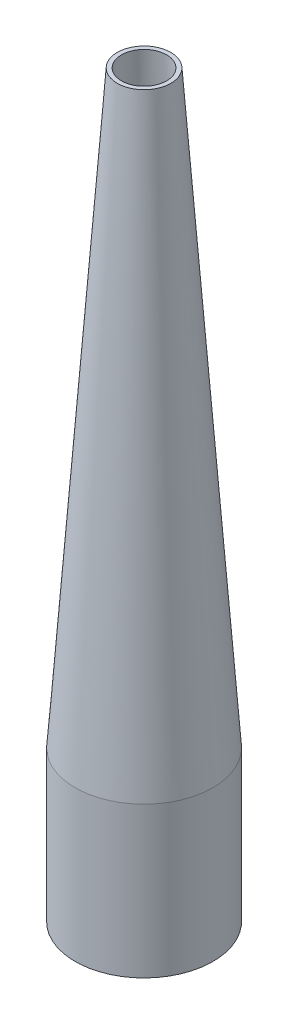
ISO-10303-21;
HEADER;
FILE_DESCRIPTION(('STEP AP214'),'2;1');
FILE_NAME('part.step','',(''),(''),'','','');
FILE_SCHEMA(('AUTOMOTIVE_DESIGN { 1 0 10303 214 1 1 1 1 }'));
ENDSEC;
DATA;
#1=APPLICATION_CONTEXT('core data for automotive mechanical design processes');
#2=APPLICATION_PROTOCOL_DEFINITION('international standard','automotive_design',2000,#1);
#3=PRODUCT_CONTEXT('',#1,'mechanical');
#4=PRODUCT('Part','Part','',(#3));
#5=PRODUCT_RELATED_PRODUCT_CATEGORY('part','',(#4));
#6=PRODUCT_DEFINITION_FORMATION('','',#4);
#7=PRODUCT_DEFINITION_CONTEXT('part definition',#1,'design');
#8=PRODUCT_DEFINITION('design','',#6,#7);
#9=PRODUCT_DEFINITION_SHAPE('','',#8);
#10=(LENGTH_UNIT() NAMED_UNIT(*) SI_UNIT(.MILLI.,.METRE.));
#11=(NAMED_UNIT(*) PLANE_ANGLE_UNIT() SI_UNIT($,.RADIAN.));
#12=(NAMED_UNIT(*) SI_UNIT($,.STERADIAN.) SOLID_ANGLE_UNIT());
#13=UNCERTAINTY_MEASURE_WITH_UNIT(LENGTH_MEASURE(1.E-05),#10,'distance_accuracy_value','');
#14=(GEOMETRIC_REPRESENTATION_CONTEXT(3) GLOBAL_UNCERTAINTY_ASSIGNED_CONTEXT((#13)) GLOBAL_UNIT_ASSIGNED_CONTEXT((#10,
#11,#12)) REPRESENTATION_CONTEXT('',''));
#15=CARTESIAN_POINT('',(0.,0.,0.));
#16=DIRECTION('',(0.,0.,1.));
#17=DIRECTION('',(1.,0.,0.));
#18=AXIS2_PLACEMENT_3D('',#15,#16,#17);
#19=CARTESIAN_POINT('',(0.,0.,0.));
#20=DIRECTION('',(0.,-1.,0.));
#21=DIRECTION('',(0.,0.,-1.));
#22=AXIS2_PLACEMENT_3D('',#19,#20,#21);
#23=PLANE('',#22);
#24=CARTESIAN_POINT('',(0.,0.,0.));
#25=DIRECTION('',(0.,-1.,0.));
#26=DIRECTION('',(0.,0.,-1.));
#27=AXIS2_PLACEMENT_3D('',#24,#25,#26);
#28=CIRCLE('',#27,27.305);
#29=CARTESIAN_POINT('',(0.,0.,-27.305));
#30=VERTEX_POINT('',#29);
#31=EDGE_CURVE('E50',#30,#30,#28,.T.);
#32=ORIENTED_EDGE('',*,*,#31,.F.);
#33=EDGE_LOOP('',(#32));
#34=FACE_BOUND('',#33,.T.);
#35=CARTESIAN_POINT('',(0.,0.,0.));
#36=DIRECTION('',(0.,-1.,0.));
#37=DIRECTION('',(0.,0.,-1.));
#38=AXIS2_PLACEMENT_3D('',#35,#36,#37);
#39=CIRCLE('',#38,29.083);
#40=CARTESIAN_POINT('',(0.,0.,-29.083));
#41=VERTEX_POINT('',#40);
#42=EDGE_CURVE('E10',#41,#41,#39,.T.);
#43=ORIENTED_EDGE('',*,*,#42,.T.);
#44=EDGE_LOOP('',(#43));
#45=FACE_BOUND('',#44,.T.);
#46=ADVANCED_FACE('F36',(#34,#45),#23,.T.);
#47=CARTESIAN_POINT('',(0.,-23.495,0.));
#48=DIRECTION('',(0.,-1.,0.));
#49=DIRECTION('',(0.,0.,-1.));
#50=AXIS2_PLACEMENT_3D('',#47,#48,#49);
#51=CYLINDRICAL_SURFACE('',#50,29.083);
#52=CARTESIAN_POINT('',(0.,63.5,0.));
#53=DIRECTION('',(0.,-1.,0.));
#54=DIRECTION('',(0.,0.,-1.));
#55=AXIS2_PLACEMENT_3D('',#52,#53,#54);
#56=CIRCLE('',#55,29.083);
#57=CARTESIAN_POINT('',(0.,63.5,-29.083));
#58=VERTEX_POINT('',#57);
#59=EDGE_CURVE('E42',#58,#58,#56,.T.);
#60=ORIENTED_EDGE('',*,*,#59,.T.);
#61=EDGE_LOOP('',(#60));
#62=FACE_BOUND('',#61,.T.);
#63=ORIENTED_EDGE('',*,*,#42,.F.);
#64=EDGE_LOOP('',(#63));
#65=FACE_BOUND('',#64,.T.);
#66=ADVANCED_FACE('F72',(#62,#65),#51,.T.);
#67=CARTESIAN_POINT('',(0.,63.5,0.));
#68=DIRECTION('',(0.,-1.,0.));
#69=DIRECTION('',(0.,0.,-1.));
#70=AXIS2_PLACEMENT_3D('',#67,#68,#69);
#71=CONICAL_SURFACE('',#70,29.083,0.071440712247248);
#72=CARTESIAN_POINT('',(0.,311.954148471616,0.));
#73=DIRECTION('',(0.,-1.,0.));
#74=DIRECTION('',(0.,0.,-1.));
#75=AXIS2_PLACEMENT_3D('',#72,#73,#74);
#76=CIRCLE('',#75,11.303);
#77=CARTESIAN_POINT('',(0.,311.954148471616,-11.303));
#78=VERTEX_POINT('',#77);
#79=EDGE_CURVE('E46',#78,#78,#76,.T.);
#80=ORIENTED_EDGE('',*,*,#79,.T.);
#81=EDGE_LOOP('',(#80));
#82=FACE_BOUND('',#81,.T.);
#83=ORIENTED_EDGE('',*,*,#59,.F.);
#84=EDGE_LOOP('',(#83));
#85=FACE_BOUND('',#84,.T.);
#86=ADVANCED_FACE('F76',(#82,#85),#71,.T.);
#87=CARTESIAN_POINT('',(0.,311.954148471616,0.));
#88=DIRECTION('',(0.,1.,0.));
#89=DIRECTION('',(0.,0.,1.));
#90=AXIS2_PLACEMENT_3D('',#87,#88,#89);
#91=PLANE('',#90);
#92=CARTESIAN_POINT('',(0.,311.954148471616,0.));
#93=DIRECTION('',(0.,1.,0.));
#94=DIRECTION('',(0.,0.,1.));
#95=AXIS2_PLACEMENT_3D('',#92,#93,#94);
#96=CIRCLE('',#95,9.52045307482425);
#97=CARTESIAN_POINT('',(0.,311.954148471616,9.52045307482425));
#98=VERTEX_POINT('',#97);
#99=EDGE_CURVE('E53',#98,#98,#96,.F.);
#100=ORIENTED_EDGE('',*,*,#99,.T.);
#101=EDGE_LOOP('',(#100));
#102=FACE_BOUND('',#101,.T.);
#103=ORIENTED_EDGE('',*,*,#79,.F.);
#104=EDGE_LOOP('',(#103));
#105=FACE_BOUND('',#104,.T.);
#106=ADVANCED_FACE('F67',(#102,#105),#91,.T.);
#107=CARTESIAN_POINT('',(0.,-23.495,0.));
#108=DIRECTION('',(0.,-1.,0.));
#109=DIRECTION('',(0.,0.,-1.));
#110=AXIS2_PLACEMENT_3D('',#107,#108,#109);
#111=CYLINDRICAL_SURFACE('',#110,27.305);
#112=CARTESIAN_POINT('',(0.,63.4364621809502,0.));
#113=DIRECTION('',(0.,-1.,0.));
#114=DIRECTION('',(0.,0.,-1.));
#115=AXIS2_PLACEMENT_3D('',#112,#113,#114);
#116=CIRCLE('',#115,27.305);
#117=CARTESIAN_POINT('',(0.,63.4364621809502,-27.305));
#118=VERTEX_POINT('',#117);
#119=EDGE_CURVE('E56',#118,#118,#116,.T.);
#120=ORIENTED_EDGE('',*,*,#119,.F.);
#121=EDGE_LOOP('',(#120));
#122=FACE_BOUND('',#121,.T.);
#123=ORIENTED_EDGE('',*,*,#31,.T.);
#124=EDGE_LOOP('',(#123));
#125=FACE_BOUND('',#124,.T.);
#126=ADVANCED_FACE('F64',(#122,#125),#111,.F.);
#127=CARTESIAN_POINT('',(0.,63.373086434329,0.));
#128=DIRECTION('',(0.,-1.,0.));
#129=DIRECTION('',(0.,0.,-1.));
#130=AXIS2_PLACEMENT_3D('',#127,#128,#129);
#131=CONICAL_SURFACE('',#130,27.3095353268676,0.071440712247248);
#132=ORIENTED_EDGE('',*,*,#99,.F.);
#133=EDGE_LOOP('',(#132));
#134=FACE_BOUND('',#133,.T.);
#135=ORIENTED_EDGE('',*,*,#119,.T.);
#136=EDGE_LOOP('',(#135));
#137=FACE_BOUND('',#136,.T.);
#138=ADVANCED_FACE('F62',(#134,#137),#131,.F.);
#139=CLOSED_SHELL('',(#46,#66,#86,#106,#126,#138));
#140=MANIFOLD_SOLID_BREP('B2',#139);
#141=ADVANCED_BREP_SHAPE_REPRESENTATION('',(#18,#140),#14);
#142=SHAPE_DEFINITION_REPRESENTATION(#9,#141);
ENDSEC;
END-ISO-10303-21;
